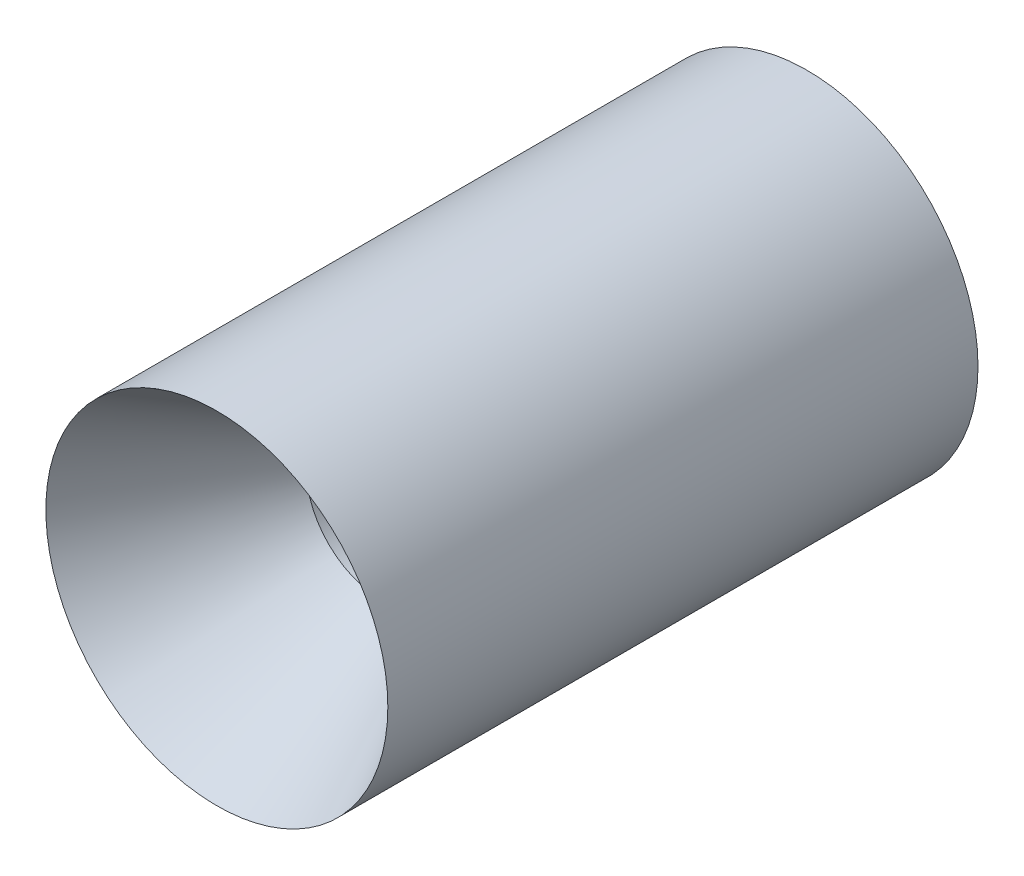
ISO-10303-21;
HEADER;
FILE_DESCRIPTION(('STEP AP214'),'2;1');
FILE_NAME('part.step','',(''),(''),'','','');
FILE_SCHEMA(('AUTOMOTIVE_DESIGN { 1 0 10303 214 1 1 1 1 }'));
ENDSEC;
DATA;
#1=APPLICATION_CONTEXT('core data for automotive mechanical design processes');
#2=APPLICATION_PROTOCOL_DEFINITION('international standard','automotive_design',2000,#1);
#3=PRODUCT_CONTEXT('',#1,'mechanical');
#4=PRODUCT('Part','Part','',(#3));
#5=PRODUCT_RELATED_PRODUCT_CATEGORY('part','',(#4));
#6=PRODUCT_DEFINITION_FORMATION('','',#4);
#7=PRODUCT_DEFINITION_CONTEXT('part definition',#1,'design');
#8=PRODUCT_DEFINITION('design','',#6,#7);
#9=PRODUCT_DEFINITION_SHAPE('','',#8);
#10=(LENGTH_UNIT() NAMED_UNIT(*) SI_UNIT(.MILLI.,.METRE.));
#11=(NAMED_UNIT(*) PLANE_ANGLE_UNIT() SI_UNIT($,.RADIAN.));
#12=(NAMED_UNIT(*) SI_UNIT($,.STERADIAN.) SOLID_ANGLE_UNIT());
#13=UNCERTAINTY_MEASURE_WITH_UNIT(LENGTH_MEASURE(1.E-05),#10,'distance_accuracy_value','');
#14=(GEOMETRIC_REPRESENTATION_CONTEXT(3) GLOBAL_UNCERTAINTY_ASSIGNED_CONTEXT((#13)) GLOBAL_UNIT_ASSIGNED_CONTEXT((#10,
#11,#12)) REPRESENTATION_CONTEXT('',''));
#15=CARTESIAN_POINT('',(0.,0.,0.));
#16=DIRECTION('',(0.,0.,1.));
#17=DIRECTION('',(1.,0.,0.));
#18=AXIS2_PLACEMENT_3D('',#15,#16,#17);
#19=CARTESIAN_POINT('',(0.,0.,0.));
#20=DIRECTION('',(0.,0.,1.));
#21=DIRECTION('',(1.,0.,0.));
#22=AXIS2_PLACEMENT_3D('',#19,#20,#21);
#23=CONICAL_SURFACE('',#22,14.351,0.5235987755983);
#24=CARTESIAN_POINT('',(0.,0.,-13.8581385113585));
#25=DIRECTION('',(0.,0.,1.));
#26=DIRECTION('',(1.,0.,0.));
#27=AXIS2_PLACEMENT_3D('',#24,#25,#26);
#28=CIRCLE('',#27,6.35);
#29=CARTESIAN_POINT('',(6.35,0.,-13.8581385113585));
#30=VERTEX_POINT('',#29);
#31=EDGE_CURVE('E10',#30,#30,#28,.T.);
#32=ORIENTED_EDGE('',*,*,#31,.F.);
#33=EDGE_LOOP('',(#32));
#34=FACE_BOUND('',#33,.T.);
#35=CARTESIAN_POINT('',(0.,0.,0.));
#36=DIRECTION('',(0.,0.,1.));
#37=DIRECTION('',(1.,0.,0.));
#38=AXIS2_PLACEMENT_3D('',#35,#36,#37);
#39=CIRCLE('',#38,14.351);
#40=CARTESIAN_POINT('',(14.351,0.,0.));
#41=VERTEX_POINT('',#40);
#42=EDGE_CURVE('E56',#41,#41,#39,.T.);
#43=ORIENTED_EDGE('',*,*,#42,.T.);
#44=EDGE_LOOP('',(#43));
#45=FACE_BOUND('',#44,.T.);
#46=ADVANCED_FACE('F37',(#34,#45),#23,.F.);
#47=CARTESIAN_POINT('',(0.,0.,0.));
#48=DIRECTION('',(0.,0.,1.));
#49=DIRECTION('',(1.,0.,0.));
#50=AXIS2_PLACEMENT_3D('',#47,#48,#49);
#51=CYLINDRICAL_SURFACE('',#50,6.35);
#52=CARTESIAN_POINT('',(0.,0.,-19.5576107688917));
#53=DIRECTION('',(0.,0.,1.));
#54=DIRECTION('',(1.,0.,0.));
#55=AXIS2_PLACEMENT_3D('',#52,#53,#54);
#56=CIRCLE('',#55,6.35);
#57=CARTESIAN_POINT('',(6.35,0.,-19.5576107688917));
#58=VERTEX_POINT('',#57);
#59=EDGE_CURVE('E43',#58,#58,#56,.T.);
#60=ORIENTED_EDGE('',*,*,#59,.F.);
#61=EDGE_LOOP('',(#60));
#62=FACE_BOUND('',#61,.T.);
#63=ORIENTED_EDGE('',*,*,#31,.T.);
#64=EDGE_LOOP('',(#63));
#65=FACE_BOUND('',#64,.T.);
#66=ADVANCED_FACE('F75',(#62,#65),#51,.F.);
#67=CARTESIAN_POINT('',(0.,0.,-19.5576107688917));
#68=DIRECTION('',(0.,0.,-1.));
#69=DIRECTION('',(-1.,0.,0.));
#70=AXIS2_PLACEMENT_3D('',#67,#68,#69);
#71=CONICAL_SURFACE('',#70,6.35,0.20943951023932);
#72=CARTESIAN_POINT('',(0.,0.,-49.53));
#73=DIRECTION('',(0.,0.,1.));
#74=DIRECTION('',(1.,0.,0.));
#75=AXIS2_PLACEMENT_3D('',#72,#73,#74);
#76=CIRCLE('',#75,12.720828);
#77=CARTESIAN_POINT('',(12.720828,0.,-49.53));
#78=VERTEX_POINT('',#77);
#79=EDGE_CURVE('E47',#78,#78,#76,.T.);
#80=ORIENTED_EDGE('',*,*,#79,.F.);
#81=EDGE_LOOP('',(#80));
#82=FACE_BOUND('',#81,.T.);
#83=ORIENTED_EDGE('',*,*,#59,.T.);
#84=EDGE_LOOP('',(#83));
#85=FACE_BOUND('',#84,.T.);
#86=ADVANCED_FACE('F70',(#82,#85),#71,.F.);
#87=CARTESIAN_POINT('',(0.,12.720828,-49.53));
#88=DIRECTION('',(0.,0.,1.));
#89=DIRECTION('',(1.,0.,0.));
#90=AXIS2_PLACEMENT_3D('',#87,#88,#89);
#91=PLANE('',#90);
#92=CARTESIAN_POINT('',(0.,0.,-49.53));
#93=DIRECTION('',(0.,0.,1.));
#94=DIRECTION('',(1.,0.,0.));
#95=AXIS2_PLACEMENT_3D('',#92,#93,#94);
#96=CIRCLE('',#95,14.351);
#97=CARTESIAN_POINT('',(14.351,0.,-49.53));
#98=VERTEX_POINT('',#97);
#99=EDGE_CURVE('E51',#98,#98,#96,.T.);
#100=ORIENTED_EDGE('',*,*,#99,.F.);
#101=EDGE_LOOP('',(#100));
#102=FACE_BOUND('',#101,.T.);
#103=ORIENTED_EDGE('',*,*,#79,.T.);
#104=EDGE_LOOP('',(#103));
#105=FACE_BOUND('',#104,.T.);
#106=ADVANCED_FACE('F64',(#102,#105),#91,.F.);
#107=CARTESIAN_POINT('',(0.,0.,0.));
#108=DIRECTION('',(0.,0.,1.));
#109=DIRECTION('',(1.,0.,0.));
#110=AXIS2_PLACEMENT_3D('',#107,#108,#109);
#111=CYLINDRICAL_SURFACE('',#110,14.351);
#112=ORIENTED_EDGE('',*,*,#42,.F.);
#113=EDGE_LOOP('',(#112));
#114=FACE_BOUND('',#113,.T.);
#115=ORIENTED_EDGE('',*,*,#99,.T.);
#116=EDGE_LOOP('',(#115));
#117=FACE_BOUND('',#116,.T.);
#118=ADVANCED_FACE('F61',(#114,#117),#111,.T.);
#119=CLOSED_SHELL('',(#46,#66,#86,#106,#118));
#120=MANIFOLD_SOLID_BREP('B2',#119);
#121=ADVANCED_BREP_SHAPE_REPRESENTATION('',(#18,#120),#14);
#122=SHAPE_DEFINITION_REPRESENTATION(#9,#121);
ENDSEC;
END-ISO-10303-21;
